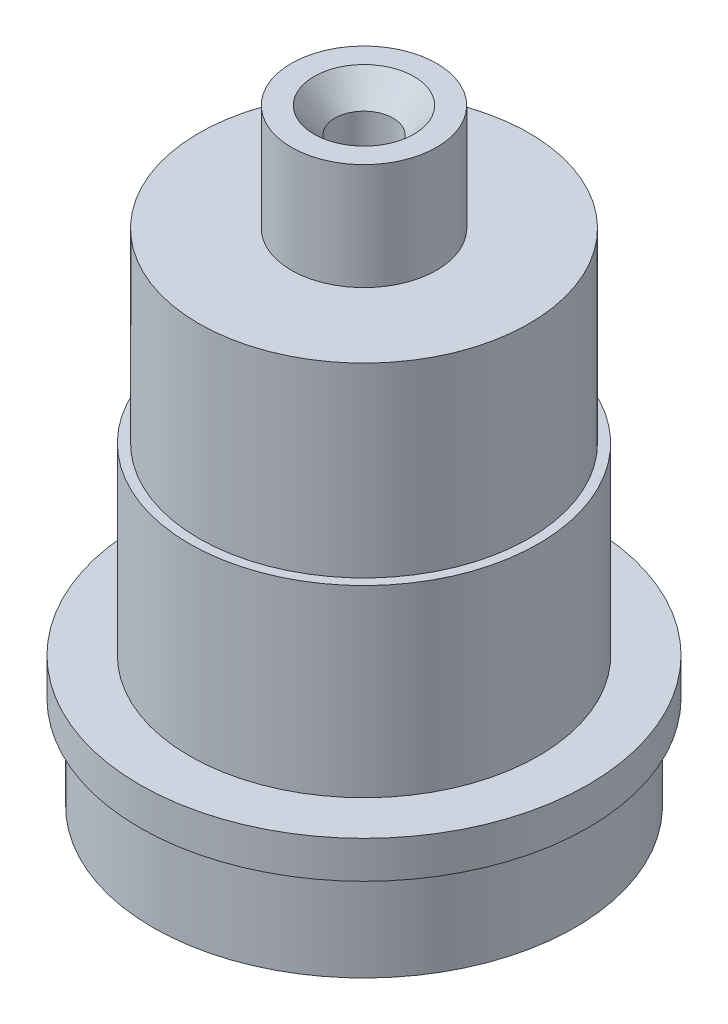
ISO-10303-21;
HEADER;
FILE_DESCRIPTION(('STEP AP214'),'2;1');
FILE_NAME('part.step','',(''),(''),'','','');
FILE_SCHEMA(('AUTOMOTIVE_DESIGN { 1 0 10303 214 1 1 1 1 }'));
ENDSEC;
DATA;
#1=APPLICATION_CONTEXT('core data for automotive mechanical design processes');
#2=APPLICATION_PROTOCOL_DEFINITION('international standard','automotive_design',2000,#1);
#3=PRODUCT_CONTEXT('',#1,'mechanical');
#4=PRODUCT('Part','Part','',(#3));
#5=PRODUCT_RELATED_PRODUCT_CATEGORY('part','',(#4));
#6=PRODUCT_DEFINITION_FORMATION('','',#4);
#7=PRODUCT_DEFINITION_CONTEXT('part definition',#1,'design');
#8=PRODUCT_DEFINITION('design','',#6,#7);
#9=PRODUCT_DEFINITION_SHAPE('','',#8);
#10=(LENGTH_UNIT() NAMED_UNIT(*) SI_UNIT(.MILLI.,.METRE.));
#11=(NAMED_UNIT(*) PLANE_ANGLE_UNIT() SI_UNIT($,.RADIAN.));
#12=(NAMED_UNIT(*) SI_UNIT($,.STERADIAN.) SOLID_ANGLE_UNIT());
#13=UNCERTAINTY_MEASURE_WITH_UNIT(LENGTH_MEASURE(1.E-05),#10,'distance_accuracy_value','');
#14=(GEOMETRIC_REPRESENTATION_CONTEXT(3) GLOBAL_UNCERTAINTY_ASSIGNED_CONTEXT((#13)) GLOBAL_UNIT_ASSIGNED_CONTEXT((#10,
#11,#12)) REPRESENTATION_CONTEXT('',''));
#15=CARTESIAN_POINT('',(0.,0.,0.));
#16=DIRECTION('',(0.,0.,1.));
#17=DIRECTION('',(1.,0.,0.));
#18=AXIS2_PLACEMENT_3D('',#15,#16,#17);
#19=CARTESIAN_POINT('',(0.,10.16,0.));
#20=DIRECTION('',(0.,-1.,0.));
#21=DIRECTION('',(0.,0.,-1.));
#22=AXIS2_PLACEMENT_3D('',#19,#20,#21);
#23=CYLINDRICAL_SURFACE('',#22,23.0505);
#24=CARTESIAN_POINT('',(0.,10.16,0.));
#25=DIRECTION('',(0.,1.,0.));
#26=DIRECTION('',(0.,0.,1.));
#27=AXIS2_PLACEMENT_3D('',#24,#25,#26);
#28=CIRCLE('',#27,23.0505);
#29=CARTESIAN_POINT('',(0.,10.16,23.0505));
#30=VERTEX_POINT('',#29);
#31=EDGE_CURVE('E79',#30,#30,#28,.T.);
#32=ORIENTED_EDGE('',*,*,#31,.F.);
#33=EDGE_LOOP('',(#32));
#34=FACE_BOUND('',#33,.T.);
#35=CARTESIAN_POINT('',(0.,0.,0.));
#36=DIRECTION('',(0.,1.,0.));
#37=DIRECTION('',(0.,0.,1.));
#38=AXIS2_PLACEMENT_3D('',#35,#36,#37);
#39=CIRCLE('',#38,23.0505);
#40=CARTESIAN_POINT('',(0.,0.,23.0505));
#41=VERTEX_POINT('',#40);
#42=EDGE_CURVE('E75',#41,#41,#39,.T.);
#43=ORIENTED_EDGE('',*,*,#42,.T.);
#44=EDGE_LOOP('',(#43));
#45=FACE_BOUND('',#44,.T.);
#46=ADVANCED_FACE('F49',(#34,#45),#23,.T.);
#47=CARTESIAN_POINT('',(0.,0.,0.));
#48=DIRECTION('',(0.,1.,0.));
#49=DIRECTION('',(0.,0.,1.));
#50=AXIS2_PLACEMENT_3D('',#47,#48,#49);
#51=PLANE('',#50);
#52=ORIENTED_EDGE('',*,*,#42,.F.);
#53=EDGE_LOOP('',(#52));
#54=FACE_BOUND('',#53,.T.);
#55=ADVANCED_FACE('F127',(#54),#51,.F.);
#56=CARTESIAN_POINT('',(0.,14.224,0.));
#57=DIRECTION('',(0.,-1.,0.));
#58=DIRECTION('',(0.,0.,-1.));
#59=AXIS2_PLACEMENT_3D('',#56,#57,#58);
#60=CYLINDRICAL_SURFACE('',#59,24.4856);
#61=CARTESIAN_POINT('',(0.,14.224,0.));
#62=DIRECTION('',(0.,1.,0.));
#63=DIRECTION('',(0.,0.,1.));
#64=AXIS2_PLACEMENT_3D('',#61,#62,#63);
#65=CIRCLE('',#64,24.4856);
#66=CARTESIAN_POINT('',(0.,14.224,24.4856));
#67=VERTEX_POINT('',#66);
#68=EDGE_CURVE('E80',#67,#67,#65,.T.);
#69=ORIENTED_EDGE('',*,*,#68,.F.);
#70=EDGE_LOOP('',(#69));
#71=FACE_BOUND('',#70,.T.);
#72=CARTESIAN_POINT('',(0.,10.16,0.));
#73=DIRECTION('',(0.,1.,0.));
#74=DIRECTION('',(0.,0.,1.));
#75=AXIS2_PLACEMENT_3D('',#72,#73,#74);
#76=CIRCLE('',#75,24.4856);
#77=CARTESIAN_POINT('',(0.,10.16,24.4856));
#78=VERTEX_POINT('',#77);
#79=EDGE_CURVE('E85',#78,#78,#76,.T.);
#80=ORIENTED_EDGE('',*,*,#79,.T.);
#81=EDGE_LOOP('',(#80));
#82=FACE_BOUND('',#81,.T.);
#83=ADVANCED_FACE('F132',(#71,#82),#60,.T.);
#84=CARTESIAN_POINT('',(0.,14.224,0.));
#85=DIRECTION('',(0.,1.,0.));
#86=DIRECTION('',(0.,0.,1.));
#87=AXIS2_PLACEMENT_3D('',#84,#85,#86);
#88=PLANE('',#87);
#89=CARTESIAN_POINT('',(0.,14.224,0.));
#90=DIRECTION('',(0.,1.,0.));
#91=DIRECTION('',(0.,0.,1.));
#92=AXIS2_PLACEMENT_3D('',#89,#90,#91);
#93=CIRCLE('',#92,19.05);
#94=CARTESIAN_POINT('',(0.,14.224,19.05));
#95=VERTEX_POINT('',#94);
#96=EDGE_CURVE('E84',#95,#95,#93,.T.);
#97=ORIENTED_EDGE('',*,*,#96,.F.);
#98=EDGE_LOOP('',(#97));
#99=FACE_BOUND('',#98,.T.);
#100=ORIENTED_EDGE('',*,*,#68,.T.);
#101=EDGE_LOOP('',(#100));
#102=FACE_BOUND('',#101,.T.);
#103=ADVANCED_FACE('F140',(#99,#102),#88,.T.);
#104=CARTESIAN_POINT('',(0.,10.16,0.));
#105=DIRECTION('',(0.,1.,0.));
#106=DIRECTION('',(0.,0.,1.));
#107=AXIS2_PLACEMENT_3D('',#104,#105,#106);
#108=PLANE('',#107);
#109=ORIENTED_EDGE('',*,*,#31,.T.);
#110=EDGE_LOOP('',(#109));
#111=FACE_BOUND('',#110,.T.);
#112=ORIENTED_EDGE('',*,*,#79,.F.);
#113=EDGE_LOOP('',(#112));
#114=FACE_BOUND('',#113,.T.);
#115=ADVANCED_FACE('F142',(#111,#114),#108,.F.);
#116=CARTESIAN_POINT('',(0.,34.29,0.));
#117=DIRECTION('',(0.,-1.,0.));
#118=DIRECTION('',(0.,0.,-1.));
#119=AXIS2_PLACEMENT_3D('',#116,#117,#118);
#120=CYLINDRICAL_SURFACE('',#119,19.05);
#121=CARTESIAN_POINT('',(0.,34.29,0.));
#122=DIRECTION('',(0.,1.,0.));
#123=DIRECTION('',(0.,0.,1.));
#124=AXIS2_PLACEMENT_3D('',#121,#122,#123);
#125=CIRCLE('',#124,19.05);
#126=CARTESIAN_POINT('',(0.,34.29,19.05));
#127=VERTEX_POINT('',#126);
#128=EDGE_CURVE('E89',#127,#127,#125,.T.);
#129=ORIENTED_EDGE('',*,*,#128,.F.);
#130=EDGE_LOOP('',(#129));
#131=FACE_BOUND('',#130,.T.);
#132=ORIENTED_EDGE('',*,*,#96,.T.);
#133=EDGE_LOOP('',(#132));
#134=FACE_BOUND('',#133,.T.);
#135=ADVANCED_FACE('F145',(#131,#134),#120,.T.);
#136=CARTESIAN_POINT('',(0.,34.29,0.));
#137=DIRECTION('',(0.,1.,0.));
#138=DIRECTION('',(0.,0.,1.));
#139=AXIS2_PLACEMENT_3D('',#136,#137,#138);
#140=PLANE('',#139);
#141=CARTESIAN_POINT('',(0.,34.29,0.));
#142=DIRECTION('',(0.,1.,0.));
#143=DIRECTION('',(0.,0.,1.));
#144=AXIS2_PLACEMENT_3D('',#141,#142,#143);
#145=CIRCLE('',#144,18.034);
#146=CARTESIAN_POINT('',(0.,34.29,18.034));
#147=VERTEX_POINT('',#146);
#148=EDGE_CURVE('E72',#147,#147,#145,.T.);
#149=ORIENTED_EDGE('',*,*,#148,.F.);
#150=EDGE_LOOP('',(#149));
#151=FACE_BOUND('',#150,.T.);
#152=ORIENTED_EDGE('',*,*,#128,.T.);
#153=EDGE_LOOP('',(#152));
#154=FACE_BOUND('',#153,.T.);
#155=ADVANCED_FACE('F151',(#151,#154),#140,.T.);
#156=CARTESIAN_POINT('',(0.,54.61,0.));
#157=DIRECTION('',(0.,-1.,0.));
#158=DIRECTION('',(0.,0.,-1.));
#159=AXIS2_PLACEMENT_3D('',#156,#157,#158);
#160=CYLINDRICAL_SURFACE('',#159,18.034);
#161=CARTESIAN_POINT('',(0.,54.61,0.));
#162=DIRECTION('',(0.,1.,0.));
#163=DIRECTION('',(0.,0.,1.));
#164=AXIS2_PLACEMENT_3D('',#161,#162,#163);
#165=CIRCLE('',#164,18.034);
#166=CARTESIAN_POINT('',(0.,54.61,18.034));
#167=VERTEX_POINT('',#166);
#168=EDGE_CURVE('E99',#167,#167,#165,.T.);
#169=ORIENTED_EDGE('',*,*,#168,.F.);
#170=EDGE_LOOP('',(#169));
#171=FACE_BOUND('',#170,.T.);
#172=ORIENTED_EDGE('',*,*,#148,.T.);
#173=EDGE_LOOP('',(#172));
#174=FACE_BOUND('',#173,.T.);
#175=ADVANCED_FACE('F155',(#171,#174),#160,.T.);
#176=CARTESIAN_POINT('',(0.,54.61,0.));
#177=DIRECTION('',(0.,1.,0.));
#178=DIRECTION('',(0.,0.,1.));
#179=AXIS2_PLACEMENT_3D('',#176,#177,#178);
#180=PLANE('',#179);
#181=CARTESIAN_POINT('',(0.,54.61,0.));
#182=DIRECTION('',(0.,1.,0.));
#183=DIRECTION('',(0.,0.,1.));
#184=AXIS2_PLACEMENT_3D('',#181,#182,#183);
#185=CIRCLE('',#184,7.9375);
#186=CARTESIAN_POINT('',(0.,54.61,7.9375));
#187=VERTEX_POINT('',#186);
#188=EDGE_CURVE('E65',#187,#187,#185,.T.);
#189=ORIENTED_EDGE('',*,*,#188,.F.);
#190=EDGE_LOOP('',(#189));
#191=FACE_BOUND('',#190,.T.);
#192=ORIENTED_EDGE('',*,*,#168,.T.);
#193=EDGE_LOOP('',(#192));
#194=FACE_BOUND('',#193,.T.);
#195=ADVANCED_FACE('F159',(#191,#194),#180,.T.);
#196=CARTESIAN_POINT('',(0.,66.2432,0.));
#197=DIRECTION('',(0.,-1.,0.));
#198=DIRECTION('',(0.,0.,-1.));
#199=AXIS2_PLACEMENT_3D('',#196,#197,#198);
#200=CYLINDRICAL_SURFACE('',#199,7.9375);
#201=CARTESIAN_POINT('',(0.,66.2432,0.));
#202=DIRECTION('',(0.,1.,0.));
#203=DIRECTION('',(0.,0.,1.));
#204=AXIS2_PLACEMENT_3D('',#201,#202,#203);
#205=CIRCLE('',#204,7.9375);
#206=CARTESIAN_POINT('',(0.,66.2432,7.9375));
#207=VERTEX_POINT('',#206);
#208=EDGE_CURVE('E104',#207,#207,#205,.T.);
#209=ORIENTED_EDGE('',*,*,#208,.F.);
#210=EDGE_LOOP('',(#209));
#211=FACE_BOUND('',#210,.T.);
#212=ORIENTED_EDGE('',*,*,#188,.T.);
#213=EDGE_LOOP('',(#212));
#214=FACE_BOUND('',#213,.T.);
#215=ADVANCED_FACE('F124',(#211,#214),#200,.T.);
#216=CARTESIAN_POINT('',(0.,66.2432,0.));
#217=DIRECTION('',(0.,1.,0.));
#218=DIRECTION('',(0.,0.,1.));
#219=AXIS2_PLACEMENT_3D('',#216,#217,#218);
#220=PLANE('',#219);
#221=CARTESIAN_POINT('',(0.,66.2432,0.));
#222=DIRECTION('',(0.,1.,0.));
#223=DIRECTION('',(0.,0.,1.));
#224=AXIS2_PLACEMENT_3D('',#221,#222,#223);
#225=CIRCLE('',#224,5.46099999999999);
#226=CARTESIAN_POINT('',(0.,66.2432,5.46099999999999));
#227=VERTEX_POINT('',#226);
#228=EDGE_CURVE('E10',#227,#227,#225,.F.);
#229=ORIENTED_EDGE('',*,*,#228,.T.);
#230=EDGE_LOOP('',(#229));
#231=FACE_BOUND('',#230,.T.);
#232=ORIENTED_EDGE('',*,*,#208,.T.);
#233=EDGE_LOOP('',(#232));
#234=FACE_BOUND('',#233,.T.);
#235=ADVANCED_FACE('F118',(#231,#234),#220,.T.);
#236=CARTESIAN_POINT('',(0.,49.2252,0.));
#237=DIRECTION('',(0.,1.,0.));
#238=DIRECTION('',(0.,0.,1.));
#239=AXIS2_PLACEMENT_3D('',#236,#237,#238);
#240=CYLINDRICAL_SURFACE('',#239,3.175);
#241=CARTESIAN_POINT('',(0.,63.4492,0.));
#242=DIRECTION('',(0.,1.,0.));
#243=DIRECTION('',(0.,0.,1.));
#244=AXIS2_PLACEMENT_3D('',#241,#242,#243);
#245=CIRCLE('',#244,3.175);
#246=CARTESIAN_POINT('',(0.,63.4492,3.175));
#247=VERTEX_POINT('',#246);
#248=EDGE_CURVE('E58',#247,#247,#245,.T.);
#249=ORIENTED_EDGE('',*,*,#248,.T.);
#250=EDGE_LOOP('',(#249));
#251=FACE_BOUND('',#250,.T.);
#252=CARTESIAN_POINT('',(0.,49.2252,0.));
#253=DIRECTION('',(0.,1.,0.));
#254=DIRECTION('',(0.,0.,1.));
#255=AXIS2_PLACEMENT_3D('',#252,#253,#254);
#256=CIRCLE('',#255,3.175);
#257=CARTESIAN_POINT('',(0.,49.2252,3.175));
#258=VERTEX_POINT('',#257);
#259=EDGE_CURVE('E108',#258,#258,#256,.T.);
#260=ORIENTED_EDGE('',*,*,#259,.F.);
#261=EDGE_LOOP('',(#260));
#262=FACE_BOUND('',#261,.T.);
#263=ADVANCED_FACE('F116',(#251,#262),#240,.F.);
#264=CARTESIAN_POINT('',(0.,49.2252,0.));
#265=DIRECTION('',(0.,1.,0.));
#266=DIRECTION('',(0.,0.,1.));
#267=AXIS2_PLACEMENT_3D('',#264,#265,#266);
#268=PLANE('',#267);
#269=ORIENTED_EDGE('',*,*,#259,.T.);
#270=EDGE_LOOP('',(#269));
#271=FACE_BOUND('',#270,.T.);
#272=ADVANCED_FACE('F114',(#271),#268,.T.);
#273=CARTESIAN_POINT('',(0.,63.4492,0.));
#274=DIRECTION('',(0.,1.,0.));
#275=DIRECTION('',(0.,0.,1.));
#276=AXIS2_PLACEMENT_3D('',#273,#274,#275);
#277=CONICAL_SURFACE('',#276,3.175,0.685729510906283);
#278=ORIENTED_EDGE('',*,*,#228,.F.);
#279=EDGE_LOOP('',(#278));
#280=FACE_BOUND('',#279,.T.);
#281=ORIENTED_EDGE('',*,*,#248,.F.);
#282=EDGE_LOOP('',(#281));
#283=FACE_BOUND('',#282,.T.);
#284=ADVANCED_FACE('F52',(#280,#283),#277,.F.);
#285=CLOSED_SHELL('',(#46,#55,#83,#103,#115,#135,#155,#175,#195,#215,#235,#263,#272,#284));
#286=MANIFOLD_SOLID_BREP('B2',#285);
#287=ADVANCED_BREP_SHAPE_REPRESENTATION('',(#18,#286),#14);
#288=SHAPE_DEFINITION_REPRESENTATION(#9,#287);
ENDSEC;
END-ISO-10303-21;
